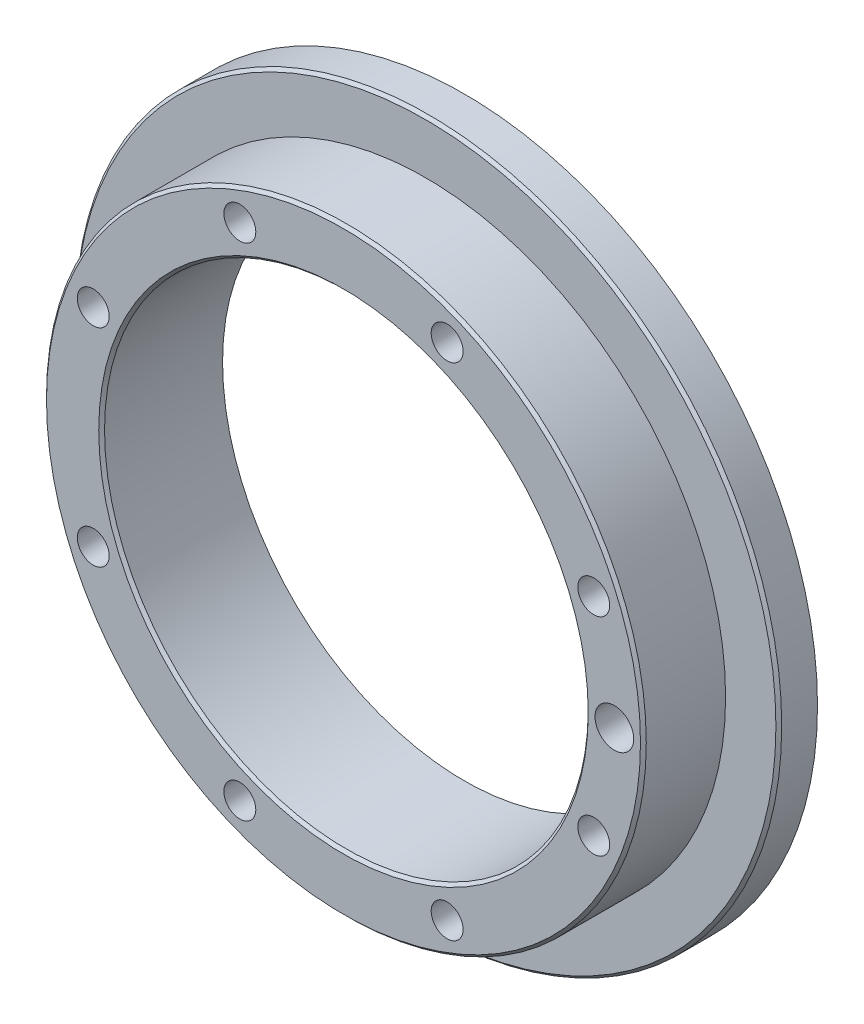
ISO-10303-21;
HEADER;
FILE_DESCRIPTION(('STEP AP214'),'2;1');
FILE_NAME('part.step','',(''),(''),'','','');
FILE_SCHEMA(('AUTOMOTIVE_DESIGN { 1 0 10303 214 1 1 1 1 }'));
ENDSEC;
DATA;
#1=APPLICATION_CONTEXT('core data for automotive mechanical design processes');
#2=APPLICATION_PROTOCOL_DEFINITION('international standard','automotive_design',2000,#1);
#3=PRODUCT_CONTEXT('',#1,'mechanical');
#4=PRODUCT('Part','Part','',(#3));
#5=PRODUCT_RELATED_PRODUCT_CATEGORY('part','',(#4));
#6=PRODUCT_DEFINITION_FORMATION('','',#4);
#7=PRODUCT_DEFINITION_CONTEXT('part definition',#1,'design');
#8=PRODUCT_DEFINITION('design','',#6,#7);
#9=PRODUCT_DEFINITION_SHAPE('','',#8);
#10=(LENGTH_UNIT() NAMED_UNIT(*) SI_UNIT(.MILLI.,.METRE.));
#11=(NAMED_UNIT(*) PLANE_ANGLE_UNIT() SI_UNIT($,.RADIAN.));
#12=(NAMED_UNIT(*) SI_UNIT($,.STERADIAN.) SOLID_ANGLE_UNIT());
#13=UNCERTAINTY_MEASURE_WITH_UNIT(LENGTH_MEASURE(1.E-05),#10,'distance_accuracy_value','');
#14=(GEOMETRIC_REPRESENTATION_CONTEXT(3) GLOBAL_UNCERTAINTY_ASSIGNED_CONTEXT((#13)) GLOBAL_UNIT_ASSIGNED_CONTEXT((#10,
#11,#12)) REPRESENTATION_CONTEXT('',''));
#15=CARTESIAN_POINT('',(0.,0.,0.));
#16=DIRECTION('',(0.,0.,1.));
#17=DIRECTION('',(1.,0.,0.));
#18=AXIS2_PLACEMENT_3D('',#15,#16,#17);
#19=CARTESIAN_POINT('',(0.,0.,0.));
#20=DIRECTION('',(0.,0.,1.));
#21=DIRECTION('',(1.,0.,0.));
#22=AXIS2_PLACEMENT_3D('',#19,#20,#21);
#23=CYLINDRICAL_SURFACE('',#22,31.);
#24=CARTESIAN_POINT('',(0.,0.,-0.299999999999967));
#25=DIRECTION('',(0.,0.,1.));
#26=DIRECTION('',(1.,0.,0.));
#27=AXIS2_PLACEMENT_3D('',#24,#25,#26);
#28=CIRCLE('',#27,31.);
#29=CARTESIAN_POINT('',(31.,0.,-0.299999999999967));
#30=VERTEX_POINT('',#29);
#31=EDGE_CURVE('E158',#30,#30,#28,.F.);
#32=ORIENTED_EDGE('',*,*,#31,.T.);
#33=EDGE_LOOP('',(#32));
#34=FACE_BOUND('',#33,.T.);
#35=CARTESIAN_POINT('',(0.,0.,-8.5));
#36=DIRECTION('',(0.,0.,1.));
#37=DIRECTION('',(1.,0.,0.));
#38=AXIS2_PLACEMENT_3D('',#35,#36,#37);
#39=CIRCLE('',#38,31.);
#40=CARTESIAN_POINT('',(31.,0.,-8.5));
#41=VERTEX_POINT('',#40);
#42=EDGE_CURVE('E140',#41,#41,#39,.T.);
#43=ORIENTED_EDGE('',*,*,#42,.T.);
#44=EDGE_LOOP('',(#43));
#45=FACE_BOUND('',#44,.T.);
#46=ADVANCED_FACE('F42',(#34,#45),#23,.T.);
#47=CARTESIAN_POINT('',(25.,0.,0.));
#48=DIRECTION('',(0.,0.,1.));
#49=DIRECTION('',(1.,0.,0.));
#50=AXIS2_PLACEMENT_3D('',#47,#48,#49);
#51=PLANE('',#50);
#52=CARTESIAN_POINT('',(10.7151361062228,-25.8686269103159,0.));
#53=DIRECTION('',(0.,0.,1.));
#54=DIRECTION('',(1.,0.,0.));
#55=AXIS2_PLACEMENT_3D('',#52,#53,#54);
#56=CIRCLE('',#55,1.65);
#57=CARTESIAN_POINT('',(12.3651361062228,-25.8686269103159,0.));
#58=VERTEX_POINT('',#57);
#59=EDGE_CURVE('E87',#58,#58,#56,.T.);
#60=ORIENTED_EDGE('',*,*,#59,.F.);
#61=EDGE_LOOP('',(#60));
#62=FACE_BOUND('',#61,.T.);
#63=CARTESIAN_POINT('',(-10.7151361062223,-25.8686269103161,0.));
#64=DIRECTION('',(0.,0.,1.));
#65=DIRECTION('',(1.,0.,0.));
#66=AXIS2_PLACEMENT_3D('',#63,#64,#65);
#67=CIRCLE('',#66,1.65);
#68=CARTESIAN_POINT('',(-9.06513610622227,-25.8686269103161,0.));
#69=VERTEX_POINT('',#68);
#70=EDGE_CURVE('E95',#69,#69,#67,.T.);
#71=ORIENTED_EDGE('',*,*,#70,.F.);
#72=EDGE_LOOP('',(#71));
#73=FACE_BOUND('',#72,.T.);
#74=CARTESIAN_POINT('',(-25.8686269103159,-10.7151361062227,0.));
#75=DIRECTION('',(0.,0.,1.));
#76=DIRECTION('',(1.,0.,0.));
#77=AXIS2_PLACEMENT_3D('',#74,#75,#76);
#78=CIRCLE('',#77,1.65);
#79=CARTESIAN_POINT('',(-24.2186269103159,-10.7151361062227,0.));
#80=VERTEX_POINT('',#79);
#81=EDGE_CURVE('E101',#80,#80,#78,.T.);
#82=ORIENTED_EDGE('',*,*,#81,.F.);
#83=EDGE_LOOP('',(#82));
#84=FACE_BOUND('',#83,.T.);
#85=CARTESIAN_POINT('',(-25.8686269103161,10.7151361062224,0.));
#86=DIRECTION('',(0.,0.,1.));
#87=DIRECTION('',(1.,0.,0.));
#88=AXIS2_PLACEMENT_3D('',#85,#86,#87);
#89=CIRCLE('',#88,1.65);
#90=CARTESIAN_POINT('',(-24.2186269103161,10.7151361062224,0.));
#91=VERTEX_POINT('',#90);
#92=EDGE_CURVE('E107',#91,#91,#89,.T.);
#93=ORIENTED_EDGE('',*,*,#92,.F.);
#94=EDGE_LOOP('',(#93));
#95=FACE_BOUND('',#94,.T.);
#96=CARTESIAN_POINT('',(-10.7151361062226,25.868626910316,0.));
#97=DIRECTION('',(0.,0.,1.));
#98=DIRECTION('',(1.,0.,0.));
#99=AXIS2_PLACEMENT_3D('',#96,#97,#98);
#100=CIRCLE('',#99,1.65);
#101=CARTESIAN_POINT('',(-9.06513610622262,25.868626910316,0.));
#102=VERTEX_POINT('',#101);
#103=EDGE_CURVE('E113',#102,#102,#100,.T.);
#104=ORIENTED_EDGE('',*,*,#103,.F.);
#105=EDGE_LOOP('',(#104));
#106=FACE_BOUND('',#105,.T.);
#107=CARTESIAN_POINT('',(10.7151361062224,25.8686269103161,0.));
#108=DIRECTION('',(0.,0.,1.));
#109=DIRECTION('',(1.,0.,0.));
#110=AXIS2_PLACEMENT_3D('',#107,#108,#109);
#111=CIRCLE('',#110,1.65);
#112=CARTESIAN_POINT('',(12.3651361062224,25.8686269103161,0.));
#113=VERTEX_POINT('',#112);
#114=EDGE_CURVE('E119',#113,#113,#111,.T.);
#115=ORIENTED_EDGE('',*,*,#114,.F.);
#116=EDGE_LOOP('',(#115));
#117=FACE_BOUND('',#116,.T.);
#118=CARTESIAN_POINT('',(25.868626910316,10.7151361062225,0.));
#119=DIRECTION('',(0.,0.,1.));
#120=DIRECTION('',(1.,0.,0.));
#121=AXIS2_PLACEMENT_3D('',#118,#119,#120);
#122=CIRCLE('',#121,1.65);
#123=CARTESIAN_POINT('',(27.518626910316,10.7151361062225,0.));
#124=VERTEX_POINT('',#123);
#125=EDGE_CURVE('E125',#124,#124,#122,.T.);
#126=ORIENTED_EDGE('',*,*,#125,.F.);
#127=EDGE_LOOP('',(#126));
#128=FACE_BOUND('',#127,.T.);
#129=CARTESIAN_POINT('',(25.868626910316,-10.7151361062225,0.));
#130=DIRECTION('',(0.,0.,1.));
#131=DIRECTION('',(1.,0.,0.));
#132=AXIS2_PLACEMENT_3D('',#129,#130,#131);
#133=CIRCLE('',#132,1.65);
#134=CARTESIAN_POINT('',(27.518626910316,-10.7151361062225,0.));
#135=VERTEX_POINT('',#134);
#136=EDGE_CURVE('E131',#135,#135,#133,.T.);
#137=ORIENTED_EDGE('',*,*,#136,.F.);
#138=EDGE_LOOP('',(#137));
#139=FACE_BOUND('',#138,.T.);
#140=CARTESIAN_POINT('',(28.,0.,0.));
#141=DIRECTION('',(0.,0.,1.));
#142=DIRECTION('',(1.,0.,0.));
#143=AXIS2_PLACEMENT_3D('',#140,#141,#142);
#144=CIRCLE('',#143,1.99999999999996);
#145=CARTESIAN_POINT('',(30.,0.,0.));
#146=VERTEX_POINT('',#145);
#147=EDGE_CURVE('E134',#146,#146,#144,.T.);
#148=ORIENTED_EDGE('',*,*,#147,.F.);
#149=EDGE_LOOP('',(#148));
#150=FACE_BOUND('',#149,.T.);
#151=CARTESIAN_POINT('',(0.,0.,0.));
#152=DIRECTION('',(0.,0.,1.));
#153=DIRECTION('',(1.,0.,0.));
#154=AXIS2_PLACEMENT_3D('',#151,#152,#153);
#155=CIRCLE('',#154,25.3);
#156=CARTESIAN_POINT('',(25.3,0.,0.));
#157=VERTEX_POINT('',#156);
#158=EDGE_CURVE('E155',#157,#157,#155,.F.);
#159=ORIENTED_EDGE('',*,*,#158,.T.);
#160=EDGE_LOOP('',(#159));
#161=FACE_BOUND('',#160,.T.);
#162=CARTESIAN_POINT('',(0.,0.,0.));
#163=DIRECTION('',(0.,0.,1.));
#164=DIRECTION('',(1.,0.,0.));
#165=AXIS2_PLACEMENT_3D('',#162,#163,#164);
#166=CIRCLE('',#165,30.7);
#167=CARTESIAN_POINT('',(30.7,0.,0.));
#168=VERTEX_POINT('',#167);
#169=EDGE_CURVE('E152',#168,#168,#166,.T.);
#170=ORIENTED_EDGE('',*,*,#169,.T.);
#171=EDGE_LOOP('',(#170));
#172=FACE_BOUND('',#171,.T.);
#173=ADVANCED_FACE('F180',(#62,#73,#84,#95,#106,#117,#128,#139,#150,#161,#172),#51,.T.);
#174=CARTESIAN_POINT('',(0.,0.,0.));
#175=DIRECTION('',(0.,0.,1.));
#176=DIRECTION('',(1.,0.,0.));
#177=AXIS2_PLACEMENT_3D('',#174,#175,#176);
#178=CYLINDRICAL_SURFACE('',#177,25.);
#179=CARTESIAN_POINT('',(0.,0.,-0.300000000000002));
#180=DIRECTION('',(0.,0.,1.));
#181=DIRECTION('',(1.,0.,0.));
#182=AXIS2_PLACEMENT_3D('',#179,#180,#181);
#183=CIRCLE('',#182,25.);
#184=CARTESIAN_POINT('',(25.,0.,-0.300000000000002));
#185=VERTEX_POINT('',#184);
#186=EDGE_CURVE('E149',#185,#185,#183,.T.);
#187=ORIENTED_EDGE('',*,*,#186,.T.);
#188=EDGE_LOOP('',(#187));
#189=FACE_BOUND('',#188,.T.);
#190=CARTESIAN_POINT('',(0.,0.,-12.5));
#191=DIRECTION('',(0.,0.,1.));
#192=DIRECTION('',(1.,0.,0.));
#193=AXIS2_PLACEMENT_3D('',#190,#191,#192);
#194=CIRCLE('',#193,25.);
#195=CARTESIAN_POINT('',(25.,0.,-12.5));
#196=VERTEX_POINT('',#195);
#197=EDGE_CURVE('E146',#196,#196,#194,.T.);
#198=ORIENTED_EDGE('',*,*,#197,.F.);
#199=EDGE_LOOP('',(#198));
#200=FACE_BOUND('',#199,.T.);
#201=ADVANCED_FACE('F186',(#189,#200),#178,.F.);
#202=CARTESIAN_POINT('',(36.5,0.,-12.5));
#203=DIRECTION('',(0.,0.,-1.));
#204=DIRECTION('',(-1.,0.,0.));
#205=AXIS2_PLACEMENT_3D('',#202,#203,#204);
#206=PLANE('',#205);
#207=ORIENTED_EDGE('',*,*,#197,.T.);
#208=EDGE_LOOP('',(#207));
#209=FACE_BOUND('',#208,.T.);
#210=CARTESIAN_POINT('',(0.,0.,-12.5));
#211=DIRECTION('',(0.,0.,1.));
#212=DIRECTION('',(1.,0.,0.));
#213=AXIS2_PLACEMENT_3D('',#210,#211,#212);
#214=CIRCLE('',#213,36.5);
#215=CARTESIAN_POINT('',(36.5,0.,-12.5));
#216=VERTEX_POINT('',#215);
#217=EDGE_CURVE('E143',#216,#216,#214,.T.);
#218=ORIENTED_EDGE('',*,*,#217,.F.);
#219=EDGE_LOOP('',(#218));
#220=FACE_BOUND('',#219,.T.);
#221=ADVANCED_FACE('F205',(#209,#220),#206,.T.);
#222=CARTESIAN_POINT('',(0.,0.,0.));
#223=DIRECTION('',(0.,0.,1.));
#224=DIRECTION('',(1.,0.,0.));
#225=AXIS2_PLACEMENT_3D('',#222,#223,#224);
#226=CYLINDRICAL_SURFACE('',#225,36.5);
#227=CARTESIAN_POINT('',(0.,0.,-8.80000000000001));
#228=DIRECTION('',(0.,0.,1.));
#229=DIRECTION('',(1.,0.,0.));
#230=AXIS2_PLACEMENT_3D('',#227,#228,#229);
#231=CIRCLE('',#230,36.5);
#232=CARTESIAN_POINT('',(36.5,0.,-8.80000000000001));
#233=VERTEX_POINT('',#232);
#234=EDGE_CURVE('E11',#233,#233,#231,.F.);
#235=ORIENTED_EDGE('',*,*,#234,.T.);
#236=EDGE_LOOP('',(#235));
#237=FACE_BOUND('',#236,.T.);
#238=ORIENTED_EDGE('',*,*,#217,.T.);
#239=EDGE_LOOP('',(#238));
#240=FACE_BOUND('',#239,.T.);
#241=ADVANCED_FACE('F197',(#237,#240),#226,.T.);
#242=CARTESIAN_POINT('',(31.,0.,-8.5));
#243=DIRECTION('',(0.,0.,1.));
#244=DIRECTION('',(1.,0.,0.));
#245=AXIS2_PLACEMENT_3D('',#242,#243,#244);
#246=PLANE('',#245);
#247=CARTESIAN_POINT('',(0.,0.,-8.5));
#248=DIRECTION('',(0.,0.,1.));
#249=DIRECTION('',(1.,0.,0.));
#250=AXIS2_PLACEMENT_3D('',#247,#248,#249);
#251=CIRCLE('',#250,36.2);
#252=CARTESIAN_POINT('',(36.2,0.,-8.5));
#253=VERTEX_POINT('',#252);
#254=EDGE_CURVE('E50',#253,#253,#251,.T.);
#255=ORIENTED_EDGE('',*,*,#254,.T.);
#256=EDGE_LOOP('',(#255));
#257=FACE_BOUND('',#256,.T.);
#258=ORIENTED_EDGE('',*,*,#42,.F.);
#259=EDGE_LOOP('',(#258));
#260=FACE_BOUND('',#259,.T.);
#261=ADVANCED_FACE('F163',(#257,#260),#246,.T.);
#262=CARTESIAN_POINT('',(0.,0.,-0.300000000000002));
#263=DIRECTION('',(0.,0.,1.));
#264=DIRECTION('',(1.,0.,0.));
#265=AXIS2_PLACEMENT_3D('',#262,#263,#264);
#266=CONICAL_SURFACE('',#265,25.,0.785398163397425);
#267=ORIENTED_EDGE('',*,*,#158,.F.);
#268=EDGE_LOOP('',(#267));
#269=FACE_BOUND('',#268,.T.);
#270=ORIENTED_EDGE('',*,*,#186,.F.);
#271=EDGE_LOOP('',(#270));
#272=FACE_BOUND('',#271,.T.);
#273=ADVANCED_FACE('F176',(#269,#272),#266,.F.);
#274=CARTESIAN_POINT('',(0.,0.,0.));
#275=DIRECTION('',(0.,0.,-1.));
#276=DIRECTION('',(-1.,0.,0.));
#277=AXIS2_PLACEMENT_3D('',#274,#275,#276);
#278=CONICAL_SURFACE('',#277,30.7,0.785398163397448);
#279=ORIENTED_EDGE('',*,*,#31,.F.);
#280=EDGE_LOOP('',(#279));
#281=FACE_BOUND('',#280,.T.);
#282=ORIENTED_EDGE('',*,*,#169,.F.);
#283=EDGE_LOOP('',(#282));
#284=FACE_BOUND('',#283,.T.);
#285=ADVANCED_FACE('F168',(#281,#284),#278,.T.);
#286=CARTESIAN_POINT('',(0.,0.,-8.5));
#287=DIRECTION('',(0.,0.,-1.));
#288=DIRECTION('',(-1.,0.,0.));
#289=AXIS2_PLACEMENT_3D('',#286,#287,#288);
#290=CONICAL_SURFACE('',#289,36.2,0.785398163397437);
#291=ORIENTED_EDGE('',*,*,#234,.F.);
#292=EDGE_LOOP('',(#291));
#293=FACE_BOUND('',#292,.T.);
#294=ORIENTED_EDGE('',*,*,#254,.F.);
#295=EDGE_LOOP('',(#294));
#296=FACE_BOUND('',#295,.T.);
#297=ADVANCED_FACE('F44',(#293,#296),#290,.T.);
#298=CARTESIAN_POINT('',(28.,0.,-6.00000000000001));
#299=DIRECTION('',(0.,0.,1.));
#300=DIRECTION('',(1.,0.,0.));
#301=AXIS2_PLACEMENT_3D('',#298,#299,#300);
#302=CONICAL_SURFACE('',#301,1.99999999999995,1.02974425867665);
#303=CARTESIAN_POINT('',(28.,0.,-7.20172123805512));
#304=VERTEX_POINT('',#303);
#305=VERTEX_LOOP('',#304);
#306=FACE_BOUND('',#305,.T.);
#307=CARTESIAN_POINT('',(28.,0.,-6.00000000000001));
#308=DIRECTION('',(0.,0.,1.));
#309=DIRECTION('',(1.,0.,0.));
#310=AXIS2_PLACEMENT_3D('',#307,#308,#309);
#311=CIRCLE('',#310,1.99999999999995);
#312=CARTESIAN_POINT('',(30.,0.,-6.00000000000001));
#313=VERTEX_POINT('',#312);
#314=EDGE_CURVE('E137',#313,#313,#311,.T.);
#315=ORIENTED_EDGE('',*,*,#314,.T.);
#316=EDGE_LOOP('',(#315));
#317=FACE_BOUND('',#316,.T.);
#318=ADVANCED_FACE('F167',(#306,#317),#302,.F.);
#319=CARTESIAN_POINT('',(28.,0.,0.));
#320=DIRECTION('',(0.,0.,1.));
#321=DIRECTION('',(1.,0.,0.));
#322=AXIS2_PLACEMENT_3D('',#319,#320,#321);
#323=CYLINDRICAL_SURFACE('',#322,1.99999999999995);
#324=ORIENTED_EDGE('',*,*,#314,.F.);
#325=EDGE_LOOP('',(#324));
#326=FACE_BOUND('',#325,.T.);
#327=ORIENTED_EDGE('',*,*,#147,.T.);
#328=EDGE_LOOP('',(#327));
#329=FACE_BOUND('',#328,.T.);
#330=ADVANCED_FACE('F174',(#326,#329),#323,.F.);
#331=CARTESIAN_POINT('',(25.868626910316,-10.7151361062225,0.));
#332=DIRECTION('',(0.,0.,1.));
#333=DIRECTION('',(1.,0.,0.));
#334=AXIS2_PLACEMENT_3D('',#331,#332,#333);
#335=CYLINDRICAL_SURFACE('',#334,1.65);
#336=CARTESIAN_POINT('',(25.868626910316,-10.7151361062225,-11.5));
#337=DIRECTION('',(0.,0.,1.));
#338=DIRECTION('',(1.,0.,0.));
#339=AXIS2_PLACEMENT_3D('',#336,#337,#338);
#340=CIRCLE('',#339,1.65);
#341=CARTESIAN_POINT('',(27.518626910316,-10.7151361062225,-11.5));
#342=VERTEX_POINT('',#341);
#343=EDGE_CURVE('E128',#342,#342,#340,.T.);
#344=ORIENTED_EDGE('',*,*,#343,.F.);
#345=EDGE_LOOP('',(#344));
#346=FACE_BOUND('',#345,.T.);
#347=ORIENTED_EDGE('',*,*,#136,.T.);
#348=EDGE_LOOP('',(#347));
#349=FACE_BOUND('',#348,.T.);
#350=ADVANCED_FACE('F221',(#346,#349),#335,.F.);
#351=CARTESIAN_POINT('',(25.868626910316,-10.7151361062225,-11.5));
#352=DIRECTION('',(0.,0.,1.));
#353=DIRECTION('',(1.,0.,0.));
#354=AXIS2_PLACEMENT_3D('',#351,#352,#353);
#355=CONICAL_SURFACE('',#354,1.65,1.02974425867665);
#356=CARTESIAN_POINT('',(25.868626910316,-10.7151361062225,-12.4914200213955));
#357=VERTEX_POINT('',#356);
#358=VERTEX_LOOP('',#357);
#359=FACE_BOUND('',#358,.T.);
#360=ORIENTED_EDGE('',*,*,#343,.T.);
#361=EDGE_LOOP('',(#360));
#362=FACE_BOUND('',#361,.T.);
#363=ADVANCED_FACE('F225',(#359,#362),#355,.F.);
#364=CARTESIAN_POINT('',(25.868626910316,10.7151361062225,0.));
#365=DIRECTION('',(0.,0.,1.));
#366=DIRECTION('',(1.,0.,0.));
#367=AXIS2_PLACEMENT_3D('',#364,#365,#366);
#368=CYLINDRICAL_SURFACE('',#367,1.65);
#369=CARTESIAN_POINT('',(25.868626910316,10.7151361062225,-11.5));
#370=DIRECTION('',(0.,0.,1.));
#371=DIRECTION('',(1.,0.,0.));
#372=AXIS2_PLACEMENT_3D('',#369,#370,#371);
#373=CIRCLE('',#372,1.65);
#374=CARTESIAN_POINT('',(27.518626910316,10.7151361062225,-11.5));
#375=VERTEX_POINT('',#374);
#376=EDGE_CURVE('E122',#375,#375,#373,.T.);
#377=ORIENTED_EDGE('',*,*,#376,.F.);
#378=EDGE_LOOP('',(#377));
#379=FACE_BOUND('',#378,.T.);
#380=ORIENTED_EDGE('',*,*,#125,.T.);
#381=EDGE_LOOP('',(#380));
#382=FACE_BOUND('',#381,.T.);
#383=ADVANCED_FACE('F229',(#379,#382),#368,.F.);
#384=CARTESIAN_POINT('',(25.868626910316,10.7151361062225,-11.5));
#385=DIRECTION('',(0.,0.,1.));
#386=DIRECTION('',(1.,0.,0.));
#387=AXIS2_PLACEMENT_3D('',#384,#385,#386);
#388=CONICAL_SURFACE('',#387,1.65,1.02974425867665);
#389=CARTESIAN_POINT('',(25.868626910316,10.7151361062225,-12.4914200213955));
#390=VERTEX_POINT('',#389);
#391=VERTEX_LOOP('',#390);
#392=FACE_BOUND('',#391,.T.);
#393=ORIENTED_EDGE('',*,*,#376,.T.);
#394=EDGE_LOOP('',(#393));
#395=FACE_BOUND('',#394,.T.);
#396=ADVANCED_FACE('F232',(#392,#395),#388,.F.);
#397=CARTESIAN_POINT('',(10.7151361062224,25.8686269103161,0.));
#398=DIRECTION('',(0.,0.,1.));
#399=DIRECTION('',(1.,0.,0.));
#400=AXIS2_PLACEMENT_3D('',#397,#398,#399);
#401=CYLINDRICAL_SURFACE('',#400,1.65);
#402=CARTESIAN_POINT('',(10.7151361062224,25.8686269103161,-11.5));
#403=DIRECTION('',(0.,0.,1.));
#404=DIRECTION('',(1.,0.,0.));
#405=AXIS2_PLACEMENT_3D('',#402,#403,#404);
#406=CIRCLE('',#405,1.65);
#407=CARTESIAN_POINT('',(12.3651361062224,25.8686269103161,-11.5));
#408=VERTEX_POINT('',#407);
#409=EDGE_CURVE('E116',#408,#408,#406,.T.);
#410=ORIENTED_EDGE('',*,*,#409,.F.);
#411=EDGE_LOOP('',(#410));
#412=FACE_BOUND('',#411,.T.);
#413=ORIENTED_EDGE('',*,*,#114,.T.);
#414=EDGE_LOOP('',(#413));
#415=FACE_BOUND('',#414,.T.);
#416=ADVANCED_FACE('F236',(#412,#415),#401,.F.);
#417=CARTESIAN_POINT('',(10.7151361062224,25.8686269103161,-11.5));
#418=DIRECTION('',(0.,0.,1.));
#419=DIRECTION('',(1.,0.,0.));
#420=AXIS2_PLACEMENT_3D('',#417,#418,#419);
#421=CONICAL_SURFACE('',#420,1.65,1.02974425867665);
#422=CARTESIAN_POINT('',(10.7151361062224,25.8686269103161,-12.4914200213955));
#423=VERTEX_POINT('',#422);
#424=VERTEX_LOOP('',#423);
#425=FACE_BOUND('',#424,.T.);
#426=ORIENTED_EDGE('',*,*,#409,.T.);
#427=EDGE_LOOP('',(#426));
#428=FACE_BOUND('',#427,.T.);
#429=ADVANCED_FACE('F240',(#425,#428),#421,.F.);
#430=CARTESIAN_POINT('',(-10.7151361062226,25.868626910316,0.));
#431=DIRECTION('',(0.,0.,1.));
#432=DIRECTION('',(1.,0.,0.));
#433=AXIS2_PLACEMENT_3D('',#430,#431,#432);
#434=CYLINDRICAL_SURFACE('',#433,1.65);
#435=CARTESIAN_POINT('',(-10.7151361062226,25.868626910316,-11.5));
#436=DIRECTION('',(0.,0.,1.));
#437=DIRECTION('',(1.,0.,0.));
#438=AXIS2_PLACEMENT_3D('',#435,#436,#437);
#439=CIRCLE('',#438,1.65);
#440=CARTESIAN_POINT('',(-9.06513610622262,25.868626910316,-11.5));
#441=VERTEX_POINT('',#440);
#442=EDGE_CURVE('E110',#441,#441,#439,.T.);
#443=ORIENTED_EDGE('',*,*,#442,.F.);
#444=EDGE_LOOP('',(#443));
#445=FACE_BOUND('',#444,.T.);
#446=ORIENTED_EDGE('',*,*,#103,.T.);
#447=EDGE_LOOP('',(#446));
#448=FACE_BOUND('',#447,.T.);
#449=ADVANCED_FACE('F244',(#445,#448),#434,.F.);
#450=CARTESIAN_POINT('',(-10.7151361062226,25.868626910316,-11.5));
#451=DIRECTION('',(0.,0.,1.));
#452=DIRECTION('',(1.,0.,0.));
#453=AXIS2_PLACEMENT_3D('',#450,#451,#452);
#454=CONICAL_SURFACE('',#453,1.65,1.02974425867665);
#455=CARTESIAN_POINT('',(-10.7151361062226,25.868626910316,-12.4914200213955));
#456=VERTEX_POINT('',#455);
#457=VERTEX_LOOP('',#456);
#458=FACE_BOUND('',#457,.T.);
#459=ORIENTED_EDGE('',*,*,#442,.T.);
#460=EDGE_LOOP('',(#459));
#461=FACE_BOUND('',#460,.T.);
#462=ADVANCED_FACE('F248',(#458,#461),#454,.F.);
#463=CARTESIAN_POINT('',(-25.8686269103161,10.7151361062224,0.));
#464=DIRECTION('',(0.,0.,1.));
#465=DIRECTION('',(1.,0.,0.));
#466=AXIS2_PLACEMENT_3D('',#463,#464,#465);
#467=CYLINDRICAL_SURFACE('',#466,1.65);
#468=CARTESIAN_POINT('',(-25.8686269103161,10.7151361062224,-11.5));
#469=DIRECTION('',(0.,0.,1.));
#470=DIRECTION('',(1.,0.,0.));
#471=AXIS2_PLACEMENT_3D('',#468,#469,#470);
#472=CIRCLE('',#471,1.65);
#473=CARTESIAN_POINT('',(-24.2186269103161,10.7151361062224,-11.5));
#474=VERTEX_POINT('',#473);
#475=EDGE_CURVE('E104',#474,#474,#472,.T.);
#476=ORIENTED_EDGE('',*,*,#475,.F.);
#477=EDGE_LOOP('',(#476));
#478=FACE_BOUND('',#477,.T.);
#479=ORIENTED_EDGE('',*,*,#92,.T.);
#480=EDGE_LOOP('',(#479));
#481=FACE_BOUND('',#480,.T.);
#482=ADVANCED_FACE('F252',(#478,#481),#467,.F.);
#483=CARTESIAN_POINT('',(-25.8686269103161,10.7151361062224,-11.5));
#484=DIRECTION('',(0.,0.,1.));
#485=DIRECTION('',(1.,0.,0.));
#486=AXIS2_PLACEMENT_3D('',#483,#484,#485);
#487=CONICAL_SURFACE('',#486,1.65,1.02974425867665);
#488=CARTESIAN_POINT('',(-25.8686269103161,10.7151361062224,-12.4914200213955));
#489=VERTEX_POINT('',#488);
#490=VERTEX_LOOP('',#489);
#491=FACE_BOUND('',#490,.T.);
#492=ORIENTED_EDGE('',*,*,#475,.T.);
#493=EDGE_LOOP('',(#492));
#494=FACE_BOUND('',#493,.T.);
#495=ADVANCED_FACE('F256',(#491,#494),#487,.F.);
#496=CARTESIAN_POINT('',(-25.8686269103159,-10.7151361062227,0.));
#497=DIRECTION('',(0.,0.,1.));
#498=DIRECTION('',(1.,0.,0.));
#499=AXIS2_PLACEMENT_3D('',#496,#497,#498);
#500=CYLINDRICAL_SURFACE('',#499,1.65);
#501=CARTESIAN_POINT('',(-25.8686269103159,-10.7151361062227,-11.5));
#502=DIRECTION('',(0.,0.,1.));
#503=DIRECTION('',(1.,0.,0.));
#504=AXIS2_PLACEMENT_3D('',#501,#502,#503);
#505=CIRCLE('',#504,1.65);
#506=CARTESIAN_POINT('',(-24.2186269103159,-10.7151361062227,-11.5));
#507=VERTEX_POINT('',#506);
#508=EDGE_CURVE('E98',#507,#507,#505,.T.);
#509=ORIENTED_EDGE('',*,*,#508,.F.);
#510=EDGE_LOOP('',(#509));
#511=FACE_BOUND('',#510,.T.);
#512=ORIENTED_EDGE('',*,*,#81,.T.);
#513=EDGE_LOOP('',(#512));
#514=FACE_BOUND('',#513,.T.);
#515=ADVANCED_FACE('F260',(#511,#514),#500,.F.);
#516=CARTESIAN_POINT('',(-25.8686269103159,-10.7151361062227,-11.5));
#517=DIRECTION('',(0.,0.,1.));
#518=DIRECTION('',(1.,0.,0.));
#519=AXIS2_PLACEMENT_3D('',#516,#517,#518);
#520=CONICAL_SURFACE('',#519,1.65,1.02974425867665);
#521=CARTESIAN_POINT('',(-25.8686269103159,-10.7151361062227,-12.4914200213955));
#522=VERTEX_POINT('',#521);
#523=VERTEX_LOOP('',#522);
#524=FACE_BOUND('',#523,.T.);
#525=ORIENTED_EDGE('',*,*,#508,.T.);
#526=EDGE_LOOP('',(#525));
#527=FACE_BOUND('',#526,.T.);
#528=ADVANCED_FACE('F264',(#524,#527),#520,.F.);
#529=CARTESIAN_POINT('',(-10.7151361062223,-25.8686269103161,0.));
#530=DIRECTION('',(0.,0.,1.));
#531=DIRECTION('',(1.,0.,0.));
#532=AXIS2_PLACEMENT_3D('',#529,#530,#531);
#533=CYLINDRICAL_SURFACE('',#532,1.65);
#534=CARTESIAN_POINT('',(-10.7151361062223,-25.8686269103161,-11.5));
#535=DIRECTION('',(0.,0.,1.));
#536=DIRECTION('',(1.,0.,0.));
#537=AXIS2_PLACEMENT_3D('',#534,#535,#536);
#538=CIRCLE('',#537,1.65);
#539=CARTESIAN_POINT('',(-9.06513610622227,-25.8686269103161,-11.5));
#540=VERTEX_POINT('',#539);
#541=EDGE_CURVE('E90',#540,#540,#538,.T.);
#542=ORIENTED_EDGE('',*,*,#541,.F.);
#543=EDGE_LOOP('',(#542));
#544=FACE_BOUND('',#543,.T.);
#545=ORIENTED_EDGE('',*,*,#70,.T.);
#546=EDGE_LOOP('',(#545));
#547=FACE_BOUND('',#546,.T.);
#548=ADVANCED_FACE('F268',(#544,#547),#533,.F.);
#549=CARTESIAN_POINT('',(-10.7151361062223,-25.8686269103161,-11.5));
#550=DIRECTION('',(0.,0.,1.));
#551=DIRECTION('',(1.,0.,0.));
#552=AXIS2_PLACEMENT_3D('',#549,#550,#551);
#553=CONICAL_SURFACE('',#552,1.65,1.02974425867665);
#554=CARTESIAN_POINT('',(-10.7151361062223,-25.8686269103161,-12.4914200213955));
#555=VERTEX_POINT('',#554);
#556=VERTEX_LOOP('',#555);
#557=FACE_BOUND('',#556,.T.);
#558=ORIENTED_EDGE('',*,*,#541,.T.);
#559=EDGE_LOOP('',(#558));
#560=FACE_BOUND('',#559,.T.);
#561=ADVANCED_FACE('F272',(#557,#560),#553,.F.);
#562=CARTESIAN_POINT('',(10.7151361062228,-25.8686269103159,0.));
#563=DIRECTION('',(0.,0.,1.));
#564=DIRECTION('',(1.,0.,0.));
#565=AXIS2_PLACEMENT_3D('',#562,#563,#564);
#566=CYLINDRICAL_SURFACE('',#565,1.65);
#567=CARTESIAN_POINT('',(10.7151361062228,-25.8686269103159,-11.5));
#568=DIRECTION('',(0.,0.,1.));
#569=DIRECTION('',(1.,0.,0.));
#570=AXIS2_PLACEMENT_3D('',#567,#568,#569);
#571=CIRCLE('',#570,1.65);
#572=CARTESIAN_POINT('',(12.3651361062228,-25.8686269103159,-11.5));
#573=VERTEX_POINT('',#572);
#574=EDGE_CURVE('E85',#573,#573,#571,.T.);
#575=ORIENTED_EDGE('',*,*,#574,.F.);
#576=EDGE_LOOP('',(#575));
#577=FACE_BOUND('',#576,.T.);
#578=ORIENTED_EDGE('',*,*,#59,.T.);
#579=EDGE_LOOP('',(#578));
#580=FACE_BOUND('',#579,.T.);
#581=ADVANCED_FACE('F81',(#577,#580),#566,.F.);
#582=CARTESIAN_POINT('',(10.7151361062228,-25.8686269103159,-11.5));
#583=DIRECTION('',(0.,0.,1.));
#584=DIRECTION('',(1.,0.,0.));
#585=AXIS2_PLACEMENT_3D('',#582,#583,#584);
#586=CONICAL_SURFACE('',#585,1.65,1.02974425867665);
#587=CARTESIAN_POINT('',(10.7151361062228,-25.8686269103159,-12.4914200213955));
#588=VERTEX_POINT('',#587);
#589=VERTEX_LOOP('',#588);
#590=FACE_BOUND('',#589,.T.);
#591=ORIENTED_EDGE('',*,*,#574,.T.);
#592=EDGE_LOOP('',(#591));
#593=FACE_BOUND('',#592,.T.);
#594=ADVANCED_FACE('F78',(#590,#593),#586,.F.);
#595=CLOSED_SHELL('',(#46,#173,#201,#221,#241,#261,#273,#285,#297,#318,#330,#350,#363,#383,#396,
#416,#429,#449,#462,#482,#495,#515,#528,#548,#561,#581,#594));
#596=MANIFOLD_SOLID_BREP('B2',#595);
#597=ADVANCED_BREP_SHAPE_REPRESENTATION('',(#18,#596),#14);
#598=SHAPE_DEFINITION_REPRESENTATION(#9,#597);
ENDSEC;
END-ISO-10303-21;
